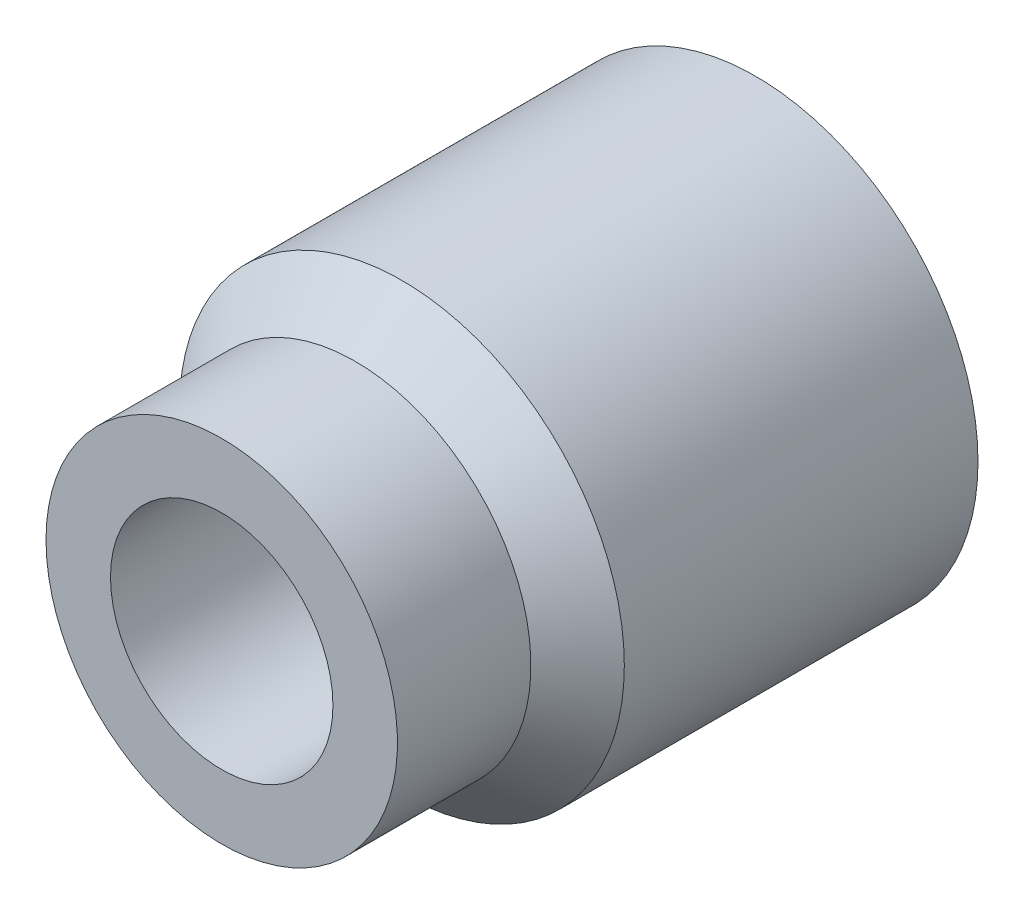
ISO-10303-21;
HEADER;
FILE_DESCRIPTION(('STEP AP214'),'2;1');
FILE_NAME('part.step','',(''),(''),'','','');
FILE_SCHEMA(('AUTOMOTIVE_DESIGN { 1 0 10303 214 1 1 1 1 }'));
ENDSEC;
DATA;
#1=APPLICATION_CONTEXT('core data for automotive mechanical design processes');
#2=APPLICATION_PROTOCOL_DEFINITION('international standard','automotive_design',2000,#1);
#3=PRODUCT_CONTEXT('',#1,'mechanical');
#4=PRODUCT('Part','Part','',(#3));
#5=PRODUCT_RELATED_PRODUCT_CATEGORY('part','',(#4));
#6=PRODUCT_DEFINITION_FORMATION('','',#4);
#7=PRODUCT_DEFINITION_CONTEXT('part definition',#1,'design');
#8=PRODUCT_DEFINITION('design','',#6,#7);
#9=PRODUCT_DEFINITION_SHAPE('','',#8);
#10=(LENGTH_UNIT() NAMED_UNIT(*) SI_UNIT(.MILLI.,.METRE.));
#11=(NAMED_UNIT(*) PLANE_ANGLE_UNIT() SI_UNIT($,.RADIAN.));
#12=(NAMED_UNIT(*) SI_UNIT($,.STERADIAN.) SOLID_ANGLE_UNIT());
#13=UNCERTAINTY_MEASURE_WITH_UNIT(LENGTH_MEASURE(1.E-05),#10,'distance_accuracy_value','');
#14=(GEOMETRIC_REPRESENTATION_CONTEXT(3) GLOBAL_UNCERTAINTY_ASSIGNED_CONTEXT((#13)) GLOBAL_UNIT_ASSIGNED_CONTEXT((#10,
#11,#12)) REPRESENTATION_CONTEXT('',''));
#15=CARTESIAN_POINT('',(0.,0.,0.));
#16=DIRECTION('',(0.,0.,1.));
#17=DIRECTION('',(1.,0.,0.));
#18=AXIS2_PLACEMENT_3D('',#15,#16,#17);
#19=CARTESIAN_POINT('',(0.,0.,1.5));
#20=DIRECTION('',(0.,0.,-1.));
#21=DIRECTION('',(-1.,0.,0.));
#22=AXIS2_PLACEMENT_3D('',#19,#20,#21);
#23=PLANE('',#22);
#24=CARTESIAN_POINT('',(0.,0.,1.5));
#25=DIRECTION('',(0.,0.,-1.));
#26=DIRECTION('',(-1.,0.,0.));
#27=AXIS2_PLACEMENT_3D('',#24,#25,#26);
#28=CIRCLE('',#27,1.25);
#29=CARTESIAN_POINT('',(-1.25,0.,1.5));
#30=VERTEX_POINT('',#29);
#31=EDGE_CURVE('E5',#30,#30,#28,.T.);
#32=ORIENTED_EDGE('',*,*,#31,.F.);
#33=EDGE_LOOP('',(#32));
#34=FACE_BOUND('',#33,.T.);
#35=ADVANCED_FACE('F9',(#34),#23,.F.);
#36=CARTESIAN_POINT('',(0.,0.,0.));
#37=DIRECTION('',(0.,0.,-1.));
#38=DIRECTION('',(-1.,0.,0.));
#39=AXIS2_PLACEMENT_3D('',#36,#37,#38);
#40=CYLINDRICAL_SURFACE('',#39,1.25);
#41=CARTESIAN_POINT('',(0.,0.,6.));
#42=DIRECTION('',(0.,0.,-1.));
#43=DIRECTION('',(-1.,0.,0.));
#44=AXIS2_PLACEMENT_3D('',#41,#42,#43);
#45=CIRCLE('',#44,1.25);
#46=CARTESIAN_POINT('',(-1.25,0.,6.));
#47=VERTEX_POINT('',#46);
#48=EDGE_CURVE('E20',#47,#47,#45,.T.);
#49=ORIENTED_EDGE('',*,*,#48,.F.);
#50=EDGE_LOOP('',(#49));
#51=FACE_BOUND('',#50,.T.);
#52=ORIENTED_EDGE('',*,*,#31,.T.);
#53=EDGE_LOOP('',(#52));
#54=FACE_BOUND('',#53,.T.);
#55=ADVANCED_FACE('F26',(#51,#54),#40,.F.);
#56=CARTESIAN_POINT('',(0.,1.25,6.));
#57=DIRECTION('',(0.,0.,-1.));
#58=DIRECTION('',(-1.,0.,0.));
#59=AXIS2_PLACEMENT_3D('',#56,#57,#58);
#60=PLANE('',#59);
#61=CARTESIAN_POINT('',(0.,0.,6.));
#62=DIRECTION('',(0.,0.,-1.));
#63=DIRECTION('',(-1.,0.,0.));
#64=AXIS2_PLACEMENT_3D('',#61,#62,#63);
#65=CIRCLE('',#64,1.975);
#66=CARTESIAN_POINT('',(-1.975,0.,6.));
#67=VERTEX_POINT('',#66);
#68=EDGE_CURVE('E33',#67,#67,#65,.T.);
#69=ORIENTED_EDGE('',*,*,#68,.F.);
#70=EDGE_LOOP('',(#69));
#71=FACE_BOUND('',#70,.T.);
#72=ORIENTED_EDGE('',*,*,#48,.T.);
#73=EDGE_LOOP('',(#72));
#74=FACE_BOUND('',#73,.T.);
#75=ADVANCED_FACE('F39',(#71,#74),#60,.F.);
#76=CARTESIAN_POINT('',(0.,0.,0.));
#77=DIRECTION('',(0.,0.,-1.));
#78=DIRECTION('',(-1.,0.,0.));
#79=AXIS2_PLACEMENT_3D('',#76,#77,#78);
#80=CYLINDRICAL_SURFACE('',#79,1.975);
#81=CARTESIAN_POINT('',(0.,0.,4.5));
#82=DIRECTION('',(0.,0.,-1.));
#83=DIRECTION('',(-1.,0.,0.));
#84=AXIS2_PLACEMENT_3D('',#81,#82,#83);
#85=CIRCLE('',#84,1.975);
#86=CARTESIAN_POINT('',(-1.975,0.,4.5));
#87=VERTEX_POINT('',#86);
#88=EDGE_CURVE('E46',#87,#87,#85,.T.);
#89=ORIENTED_EDGE('',*,*,#88,.F.);
#90=EDGE_LOOP('',(#89));
#91=FACE_BOUND('',#90,.T.);
#92=ORIENTED_EDGE('',*,*,#68,.T.);
#93=EDGE_LOOP('',(#92));
#94=FACE_BOUND('',#93,.T.);
#95=ADVANCED_FACE('F52',(#91,#94),#80,.T.);
#96=CARTESIAN_POINT('',(0.,0.,4.5));
#97=DIRECTION('',(0.,0.,-1.));
#98=DIRECTION('',(-1.,0.,0.));
#99=AXIS2_PLACEMENT_3D('',#96,#97,#98);
#100=CONICAL_SURFACE('',#99,1.975,0.785398163397448);
#101=CARTESIAN_POINT('',(0.,0.,3.975));
#102=DIRECTION('',(0.,0.,-1.));
#103=DIRECTION('',(-1.,0.,0.));
#104=AXIS2_PLACEMENT_3D('',#101,#102,#103);
#105=CIRCLE('',#104,2.5);
#106=CARTESIAN_POINT('',(-2.5,0.,3.975));
#107=VERTEX_POINT('',#106);
#108=EDGE_CURVE('E59',#107,#107,#105,.T.);
#109=ORIENTED_EDGE('',*,*,#108,.F.);
#110=EDGE_LOOP('',(#109));
#111=FACE_BOUND('',#110,.T.);
#112=ORIENTED_EDGE('',*,*,#88,.T.);
#113=EDGE_LOOP('',(#112));
#114=FACE_BOUND('',#113,.T.);
#115=ADVANCED_FACE('F65',(#111,#114),#100,.T.);
#116=CARTESIAN_POINT('',(0.,0.,0.));
#117=DIRECTION('',(0.,0.,-1.));
#118=DIRECTION('',(-1.,0.,0.));
#119=AXIS2_PLACEMENT_3D('',#116,#117,#118);
#120=CYLINDRICAL_SURFACE('',#119,2.5);
#121=CARTESIAN_POINT('',(0.,0.,0.));
#122=DIRECTION('',(0.,0.,-1.));
#123=DIRECTION('',(-1.,0.,0.));
#124=AXIS2_PLACEMENT_3D('',#121,#122,#123);
#125=CIRCLE('',#124,2.5);
#126=CARTESIAN_POINT('',(-2.5,0.,0.));
#127=VERTEX_POINT('',#126);
#128=EDGE_CURVE('E72',#127,#127,#125,.T.);
#129=ORIENTED_EDGE('',*,*,#128,.F.);
#130=EDGE_LOOP('',(#129));
#131=FACE_BOUND('',#130,.T.);
#132=ORIENTED_EDGE('',*,*,#108,.T.);
#133=EDGE_LOOP('',(#132));
#134=FACE_BOUND('',#133,.T.);
#135=ADVANCED_FACE('F78',(#131,#134),#120,.T.);
#136=CARTESIAN_POINT('',(0.,2.5,0.));
#137=DIRECTION('',(0.,0.,1.));
#138=DIRECTION('',(1.,0.,0.));
#139=AXIS2_PLACEMENT_3D('',#136,#137,#138);
#140=PLANE('',#139);
#141=DIRECTION('',(0.,-1.,0.));
#142=VECTOR('',#141,1.);
#143=CARTESIAN_POINT('',(1.9,0.4,0.));
#144=LINE('',#143,#142);
#145=CARTESIAN_POINT('',(1.9,0.4,0.));
#146=VERTEX_POINT('',#145);
#147=CARTESIAN_POINT('',(1.9,-0.4,0.));
#148=VERTEX_POINT('',#147);
#149=EDGE_CURVE('E87',#146,#148,#144,.T.);
#150=ORIENTED_EDGE('',*,*,#149,.F.);
#151=DIRECTION('',(-1.,0.,0.));
#152=VECTOR('',#151,1.);
#153=CARTESIAN_POINT('',(1.9,0.4,0.));
#154=LINE('',#153,#152);
#155=CARTESIAN_POINT('',(-1.9,0.4,0.));
#156=VERTEX_POINT('',#155);
#157=EDGE_CURVE('E94',#146,#156,#154,.T.);
#158=ORIENTED_EDGE('',*,*,#157,.T.);
#159=DIRECTION('',(0.,-1.,0.));
#160=VECTOR('',#159,1.);
#161=CARTESIAN_POINT('',(-1.9,0.4,0.));
#162=LINE('',#161,#160);
#163=CARTESIAN_POINT('',(-1.9,-0.4,0.));
#164=VERTEX_POINT('',#163);
#165=EDGE_CURVE('E101',#156,#164,#162,.T.);
#166=ORIENTED_EDGE('',*,*,#165,.T.);
#167=DIRECTION('',(-1.,0.,0.));
#168=VECTOR('',#167,1.);
#169=CARTESIAN_POINT('',(1.9,-0.4,0.));
#170=LINE('',#169,#168);
#171=EDGE_CURVE('E108',#148,#164,#170,.T.);
#172=ORIENTED_EDGE('',*,*,#171,.F.);
#173=EDGE_LOOP('',(#150,#158,#166,#172));
#174=FACE_BOUND('',#173,.T.);
#175=ORIENTED_EDGE('',*,*,#128,.T.);
#176=EDGE_LOOP('',(#175));
#177=FACE_BOUND('',#176,.T.);
#178=ADVANCED_FACE('F116',(#174,#177),#140,.F.);
#179=CARTESIAN_POINT('',(1.9,0.4,1.));
#180=DIRECTION('',(-1.,0.,0.));
#181=DIRECTION('',(0.,0.,1.));
#182=AXIS2_PLACEMENT_3D('',#179,#180,#181);
#183=PLANE('',#182);
#184=DIRECTION('',(0.,0.,-1.));
#185=VECTOR('',#184,1.);
#186=CARTESIAN_POINT('',(1.9,-0.4,1.));
#187=LINE('',#186,#185);
#188=CARTESIAN_POINT('',(1.9,-0.4,1.));
#189=VERTEX_POINT('',#188);
#190=EDGE_CURVE('E125',#189,#148,#187,.T.);
#191=ORIENTED_EDGE('',*,*,#190,.F.);
#192=DIRECTION('',(0.,-1.,0.));
#193=VECTOR('',#192,1.);
#194=CARTESIAN_POINT('',(1.9,0.4,1.));
#195=LINE('',#194,#193);
#196=CARTESIAN_POINT('',(1.9,0.4,1.));
#197=VERTEX_POINT('',#196);
#198=EDGE_CURVE('E132',#197,#189,#195,.T.);
#199=ORIENTED_EDGE('',*,*,#198,.F.);
#200=DIRECTION('',(0.,0.,-1.));
#201=VECTOR('',#200,1.);
#202=CARTESIAN_POINT('',(1.9,0.4,1.));
#203=LINE('',#202,#201);
#204=EDGE_CURVE('E139',#197,#146,#203,.T.);
#205=ORIENTED_EDGE('',*,*,#204,.T.);
#206=ORIENTED_EDGE('',*,*,#149,.T.);
#207=EDGE_LOOP('',(#191,#199,#205,#206));
#208=FACE_BOUND('',#207,.T.);
#209=ADVANCED_FACE('F144',(#208),#183,.T.);
#210=CARTESIAN_POINT('',(0.,0.4,0.));
#211=DIRECTION('',(0.,1.,0.));
#212=DIRECTION('',(0.,0.,1.));
#213=AXIS2_PLACEMENT_3D('',#210,#211,#212);
#214=PLANE('',#213);
#215=DIRECTION('',(0.,0.,1.));
#216=VECTOR('',#215,1.);
#217=CARTESIAN_POINT('',(-1.9,0.4,0.));
#218=LINE('',#217,#216);
#219=CARTESIAN_POINT('',(-1.9,0.4,1.));
#220=VERTEX_POINT('',#219);
#221=EDGE_CURVE('E153',#156,#220,#218,.T.);
#222=ORIENTED_EDGE('',*,*,#221,.F.);
#223=ORIENTED_EDGE('',*,*,#157,.F.);
#224=ORIENTED_EDGE('',*,*,#204,.F.);
#225=DIRECTION('',(1.,0.,0.));
#226=VECTOR('',#225,1.);
#227=CARTESIAN_POINT('',(-1.9,0.4,1.));
#228=LINE('',#227,#226);
#229=EDGE_CURVE('E160',#220,#197,#228,.T.);
#230=ORIENTED_EDGE('',*,*,#229,.F.);
#231=EDGE_LOOP('',(#222,#223,#224,#230));
#232=FACE_BOUND('',#231,.T.);
#233=ADVANCED_FACE('F166',(#232),#214,.F.);
#234=CARTESIAN_POINT('',(-1.9,0.4,0.));
#235=DIRECTION('',(1.,0.,0.));
#236=DIRECTION('',(0.,0.,-1.));
#237=AXIS2_PLACEMENT_3D('',#234,#235,#236);
#238=PLANE('',#237);
#239=DIRECTION('',(0.,0.,1.));
#240=VECTOR('',#239,1.);
#241=CARTESIAN_POINT('',(-1.9,-0.4,0.));
#242=LINE('',#241,#240);
#243=CARTESIAN_POINT('',(-1.9,-0.4,1.));
#244=VERTEX_POINT('',#243);
#245=EDGE_CURVE('E175',#164,#244,#242,.T.);
#246=ORIENTED_EDGE('',*,*,#245,.F.);
#247=ORIENTED_EDGE('',*,*,#165,.F.);
#248=ORIENTED_EDGE('',*,*,#221,.T.);
#249=DIRECTION('',(0.,-1.,0.));
#250=VECTOR('',#249,1.);
#251=CARTESIAN_POINT('',(-1.9,0.4,1.));
#252=LINE('',#251,#250);
#253=EDGE_CURVE('E182',#220,#244,#252,.T.);
#254=ORIENTED_EDGE('',*,*,#253,.T.);
#255=EDGE_LOOP('',(#246,#247,#248,#254));
#256=FACE_BOUND('',#255,.T.);
#257=ADVANCED_FACE('F188',(#256),#238,.T.);
#258=CARTESIAN_POINT('',(0.,-0.4,0.));
#259=DIRECTION('',(0.,1.,0.));
#260=DIRECTION('',(0.,0.,1.));
#261=AXIS2_PLACEMENT_3D('',#258,#259,#260);
#262=PLANE('',#261);
#263=ORIENTED_EDGE('',*,*,#245,.T.);
#264=DIRECTION('',(1.,0.,0.));
#265=VECTOR('',#264,1.);
#266=CARTESIAN_POINT('',(-1.9,-0.4,1.));
#267=LINE('',#266,#265);
#268=EDGE_CURVE('E198',#244,#189,#267,.T.);
#269=ORIENTED_EDGE('',*,*,#268,.T.);
#270=ORIENTED_EDGE('',*,*,#190,.T.);
#271=ORIENTED_EDGE('',*,*,#171,.T.);
#272=EDGE_LOOP('',(#263,#269,#270,#271));
#273=FACE_BOUND('',#272,.T.);
#274=ADVANCED_FACE('F204',(#273),#262,.T.);
#275=CARTESIAN_POINT('',(-1.9,0.4,1.));
#276=DIRECTION('',(0.,0.,-1.));
#277=DIRECTION('',(-1.,0.,0.));
#278=AXIS2_PLACEMENT_3D('',#275,#276,#277);
#279=PLANE('',#278);
#280=ORIENTED_EDGE('',*,*,#268,.F.);
#281=ORIENTED_EDGE('',*,*,#253,.F.);
#282=ORIENTED_EDGE('',*,*,#229,.T.);
#283=ORIENTED_EDGE('',*,*,#198,.T.);
#284=EDGE_LOOP('',(#280,#281,#282,#283));
#285=FACE_BOUND('',#284,.T.);
#286=ADVANCED_FACE('F216',(#285),#279,.T.);
#287=CLOSED_SHELL('',(#35,#55,#75,#95,#115,#135,#178,#209,#233,#257,#274,#286));
#288=MANIFOLD_SOLID_BREP('B1',#287);
#289=ADVANCED_BREP_SHAPE_REPRESENTATION('',(#18,#288),#14);
#290=SHAPE_DEFINITION_REPRESENTATION(#9,#289);
ENDSEC;
END-ISO-10303-21;
